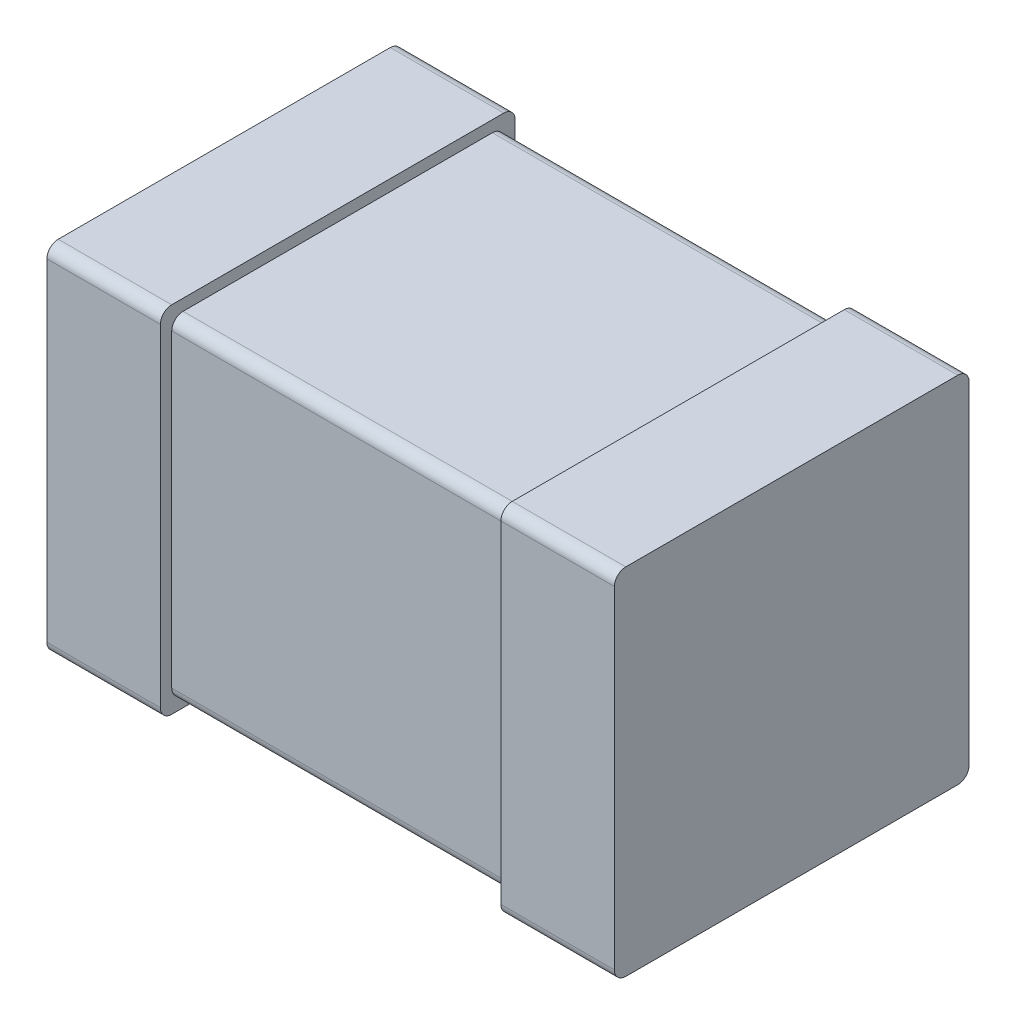
ISO-10303-21;
HEADER;
FILE_DESCRIPTION(('STEP AP214'),'2;1');
FILE_NAME('part.step','',(''),(''),'','','');
FILE_SCHEMA(('AUTOMOTIVE_DESIGN { 1 0 10303 214 1 1 1 1 }'));
ENDSEC;
DATA;
#1=APPLICATION_CONTEXT('core data for automotive mechanical design processes');
#2=APPLICATION_PROTOCOL_DEFINITION('international standard','automotive_design',2000,#1);
#3=PRODUCT_CONTEXT('',#1,'mechanical');
#4=PRODUCT('Part','Part','',(#3));
#5=PRODUCT_RELATED_PRODUCT_CATEGORY('part','',(#4));
#6=PRODUCT_DEFINITION_FORMATION('','',#4);
#7=PRODUCT_DEFINITION_CONTEXT('part definition',#1,'design');
#8=PRODUCT_DEFINITION('design','',#6,#7);
#9=PRODUCT_DEFINITION_SHAPE('','',#8);
#10=(LENGTH_UNIT() NAMED_UNIT(*) SI_UNIT(.MILLI.,.METRE.));
#11=(NAMED_UNIT(*) PLANE_ANGLE_UNIT() SI_UNIT($,.RADIAN.));
#12=(NAMED_UNIT(*) SI_UNIT($,.STERADIAN.) SOLID_ANGLE_UNIT());
#13=UNCERTAINTY_MEASURE_WITH_UNIT(LENGTH_MEASURE(1.E-05),#10,'distance_accuracy_value','');
#14=(GEOMETRIC_REPRESENTATION_CONTEXT(3) GLOBAL_UNCERTAINTY_ASSIGNED_CONTEXT((#13)) GLOBAL_UNIT_ASSIGNED_CONTEXT((#10,
#11,#12)) REPRESENTATION_CONTEXT('',''));
#15=CARTESIAN_POINT('',(0.,0.,0.));
#16=DIRECTION('',(0.,0.,1.));
#17=DIRECTION('',(1.,0.,0.));
#18=AXIS2_PLACEMENT_3D('',#15,#16,#17);
#19=CARTESIAN_POINT('',(1.,-0.625,0.));
#20=DIRECTION('',(1.,0.,0.));
#21=DIRECTION('',(0.,1.,0.));
#22=AXIS2_PLACEMENT_3D('',#19,#20,#21);
#23=PLANE('',#22);
#24=DIRECTION('',(0.,0.,1.));
#25=VECTOR('',#24,1.);
#26=CARTESIAN_POINT('',(1.,-0.625,0.));
#27=LINE('',#26,#25);
#28=CARTESIAN_POINT('',(1.,-0.625,0.04));
#29=VERTEX_POINT('',#28);
#30=CARTESIAN_POINT('',(1.,-0.625,1.21));
#31=VERTEX_POINT('',#30);
#32=EDGE_CURVE('E394',#29,#31,#27,.T.);
#33=ORIENTED_EDGE('',*,*,#32,.F.);
#34=CARTESIAN_POINT('',(1.,-0.585,0.04));
#35=DIRECTION('',(1.,0.,0.));
#36=DIRECTION('',(0.,0.,1.));
#37=AXIS2_PLACEMENT_3D('',#34,#35,#36);
#38=CIRCLE('',#37,0.04);
#39=CARTESIAN_POINT('',(1.,-0.585,0.));
#40=VERTEX_POINT('',#39);
#41=EDGE_CURVE('E355',#29,#40,#38,.T.);
#42=ORIENTED_EDGE('',*,*,#41,.T.);
#43=DIRECTION('',(0.,1.,0.));
#44=VECTOR('',#43,1.);
#45=CARTESIAN_POINT('',(1.,-0.625,0.));
#46=LINE('',#45,#44);
#47=CARTESIAN_POINT('',(1.,0.585,0.));
#48=VERTEX_POINT('',#47);
#49=EDGE_CURVE('E308',#40,#48,#46,.T.);
#50=ORIENTED_EDGE('',*,*,#49,.T.);
#51=CARTESIAN_POINT('',(1.,0.585,0.04));
#52=DIRECTION('',(-1.,0.,0.));
#53=DIRECTION('',(0.,0.,1.));
#54=AXIS2_PLACEMENT_3D('',#51,#52,#53);
#55=CIRCLE('',#54,0.04);
#56=CARTESIAN_POINT('',(1.,0.625,0.04));
#57=VERTEX_POINT('',#56);
#58=EDGE_CURVE('E184',#57,#48,#55,.T.);
#59=ORIENTED_EDGE('',*,*,#58,.F.);
#60=DIRECTION('',(0.,0.,1.));
#61=VECTOR('',#60,1.);
#62=CARTESIAN_POINT('',(1.,0.625,0.));
#63=LINE('',#62,#61);
#64=CARTESIAN_POINT('',(1.,0.625,1.21));
#65=VERTEX_POINT('',#64);
#66=EDGE_CURVE('E11',#57,#65,#63,.T.);
#67=ORIENTED_EDGE('',*,*,#66,.T.);
#68=CARTESIAN_POINT('',(1.,0.585,1.21));
#69=DIRECTION('',(1.,0.,0.));
#70=DIRECTION('',(0.,0.,1.));
#71=AXIS2_PLACEMENT_3D('',#68,#69,#70);
#72=CIRCLE('',#71,0.04);
#73=CARTESIAN_POINT('',(1.,0.585,1.25));
#74=VERTEX_POINT('',#73);
#75=EDGE_CURVE('E190',#65,#74,#72,.T.);
#76=ORIENTED_EDGE('',*,*,#75,.T.);
#77=DIRECTION('',(0.,1.,0.));
#78=VECTOR('',#77,1.);
#79=CARTESIAN_POINT('',(1.,-0.625,1.25));
#80=LINE('',#79,#78);
#81=CARTESIAN_POINT('',(1.,-0.585,1.25));
#82=VERTEX_POINT('',#81);
#83=EDGE_CURVE('E312',#82,#74,#80,.T.);
#84=ORIENTED_EDGE('',*,*,#83,.F.);
#85=CARTESIAN_POINT('',(1.,-0.585,1.21));
#86=DIRECTION('',(-1.,0.,0.));
#87=DIRECTION('',(0.,0.,1.));
#88=AXIS2_PLACEMENT_3D('',#85,#86,#87);
#89=CIRCLE('',#88,0.04);
#90=EDGE_CURVE('E351',#31,#82,#89,.T.);
#91=ORIENTED_EDGE('',*,*,#90,.F.);
#92=EDGE_LOOP('',(#33,#42,#50,#59,#67,#76,#84,#91));
#93=FACE_BOUND('',#92,.T.);
#94=ADVANCED_FACE('F17',(#93),#23,.T.);
#95=CARTESIAN_POINT('',(0.6,0.625,0.));
#96=DIRECTION('',(0.,1.,0.));
#97=DIRECTION('',(1.,0.,0.));
#98=AXIS2_PLACEMENT_3D('',#95,#96,#97);
#99=PLANE('',#98);
#100=ORIENTED_EDGE('',*,*,#66,.F.);
#101=DIRECTION('',(1.,0.,0.));
#102=VECTOR('',#101,1.);
#103=CARTESIAN_POINT('',(0.6,0.625,0.04));
#104=LINE('',#103,#102);
#105=CARTESIAN_POINT('',(0.6,0.625,0.04));
#106=VERTEX_POINT('',#105);
#107=EDGE_CURVE('E21',#106,#57,#104,.T.);
#108=ORIENTED_EDGE('',*,*,#107,.F.);
#109=DIRECTION('',(0.,0.,1.));
#110=VECTOR('',#109,1.);
#111=CARTESIAN_POINT('',(0.6,0.625,0.));
#112=LINE('',#111,#110);
#113=CARTESIAN_POINT('',(0.6,0.625,1.21));
#114=VERTEX_POINT('',#113);
#115=EDGE_CURVE('E340',#106,#114,#112,.T.);
#116=ORIENTED_EDGE('',*,*,#115,.T.);
#117=DIRECTION('',(1.,0.,0.));
#118=VECTOR('',#117,1.);
#119=CARTESIAN_POINT('',(0.6,0.625,1.21));
#120=LINE('',#119,#118);
#121=EDGE_CURVE('E28',#114,#65,#120,.T.);
#122=ORIENTED_EDGE('',*,*,#121,.T.);
#123=EDGE_LOOP('',(#100,#108,#116,#122));
#124=FACE_BOUND('',#123,.T.);
#125=ADVANCED_FACE('F603',(#124),#99,.T.);
#126=CARTESIAN_POINT('',(0.6,0.585,1.21));
#127=DIRECTION('',(1.,0.,0.));
#128=DIRECTION('',(0.,1.,0.));
#129=AXIS2_PLACEMENT_3D('',#126,#127,#128);
#130=CYLINDRICAL_SURFACE('',#129,0.04);
#131=CARTESIAN_POINT('',(0.6,0.585,1.21));
#132=DIRECTION('',(1.,0.,0.));
#133=DIRECTION('',(0.,0.,1.));
#134=AXIS2_PLACEMENT_3D('',#131,#132,#133);
#135=CIRCLE('',#134,0.04);
#136=CARTESIAN_POINT('',(0.6,0.585,1.25));
#137=VERTEX_POINT('',#136);
#138=EDGE_CURVE('E415',#114,#137,#135,.T.);
#139=ORIENTED_EDGE('',*,*,#138,.T.);
#140=DIRECTION('',(1.,0.,0.));
#141=VECTOR('',#140,1.);
#142=CARTESIAN_POINT('',(0.6,0.585,1.25));
#143=LINE('',#142,#141);
#144=EDGE_CURVE('E310',#137,#74,#143,.T.);
#145=ORIENTED_EDGE('',*,*,#144,.T.);
#146=ORIENTED_EDGE('',*,*,#75,.F.);
#147=ORIENTED_EDGE('',*,*,#121,.F.);
#148=EDGE_LOOP('',(#139,#145,#146,#147));
#149=FACE_BOUND('',#148,.T.);
#150=ADVANCED_FACE('F502',(#149),#130,.T.);
#151=CARTESIAN_POINT('',(0.6,0.585,0.04));
#152=DIRECTION('',(1.,0.,0.));
#153=DIRECTION('',(0.,1.,0.));
#154=AXIS2_PLACEMENT_3D('',#151,#152,#153);
#155=CYLINDRICAL_SURFACE('',#154,0.04);
#156=ORIENTED_EDGE('',*,*,#107,.T.);
#157=ORIENTED_EDGE('',*,*,#58,.T.);
#158=DIRECTION('',(1.,0.,0.));
#159=VECTOR('',#158,1.);
#160=CARTESIAN_POINT('',(0.6,0.585,0.));
#161=LINE('',#160,#159);
#162=CARTESIAN_POINT('',(0.6,0.585,0.));
#163=VERTEX_POINT('',#162);
#164=EDGE_CURVE('E305',#163,#48,#161,.T.);
#165=ORIENTED_EDGE('',*,*,#164,.F.);
#166=CARTESIAN_POINT('',(0.6,0.585,0.04));
#167=DIRECTION('',(-1.,0.,0.));
#168=DIRECTION('',(0.,0.,1.));
#169=AXIS2_PLACEMENT_3D('',#166,#167,#168);
#170=CIRCLE('',#169,0.04);
#171=EDGE_CURVE('E335',#106,#163,#170,.T.);
#172=ORIENTED_EDGE('',*,*,#171,.F.);
#173=EDGE_LOOP('',(#156,#157,#165,#172));
#174=FACE_BOUND('',#173,.T.);
#175=ADVANCED_FACE('F627',(#174),#155,.T.);
#176=CARTESIAN_POINT('',(0.6,-0.625,1.25));
#177=DIRECTION('',(0.,0.,1.));
#178=DIRECTION('',(1.,0.,0.));
#179=AXIS2_PLACEMENT_3D('',#176,#177,#178);
#180=PLANE('',#179);
#181=DIRECTION('',(0.,1.,0.));
#182=VECTOR('',#181,1.);
#183=CARTESIAN_POINT('',(0.6,-0.625,1.25));
#184=LINE('',#183,#182);
#185=CARTESIAN_POINT('',(0.6,-0.585,1.25));
#186=VERTEX_POINT('',#185);
#187=EDGE_CURVE('E412',#186,#137,#184,.T.);
#188=ORIENTED_EDGE('',*,*,#187,.F.);
#189=DIRECTION('',(1.,0.,0.));
#190=VECTOR('',#189,1.);
#191=CARTESIAN_POINT('',(0.6,-0.585,1.25));
#192=LINE('',#191,#190);
#193=EDGE_CURVE('E309',#186,#82,#192,.T.);
#194=ORIENTED_EDGE('',*,*,#193,.T.);
#195=ORIENTED_EDGE('',*,*,#83,.T.);
#196=ORIENTED_EDGE('',*,*,#144,.F.);
#197=EDGE_LOOP('',(#188,#194,#195,#196));
#198=FACE_BOUND('',#197,.T.);
#199=ADVANCED_FACE('F501',(#198),#180,.T.);
#200=CARTESIAN_POINT('',(0.6,-0.625,0.));
#201=DIRECTION('',(0.,0.,1.));
#202=DIRECTION('',(1.,0.,0.));
#203=AXIS2_PLACEMENT_3D('',#200,#201,#202);
#204=PLANE('',#203);
#205=ORIENTED_EDGE('',*,*,#164,.T.);
#206=ORIENTED_EDGE('',*,*,#49,.F.);
#207=DIRECTION('',(1.,0.,0.));
#208=VECTOR('',#207,1.);
#209=CARTESIAN_POINT('',(0.6,-0.585,0.));
#210=LINE('',#209,#208);
#211=CARTESIAN_POINT('',(0.6,-0.585,0.));
#212=VERTEX_POINT('',#211);
#213=EDGE_CURVE('E406',#212,#40,#210,.T.);
#214=ORIENTED_EDGE('',*,*,#213,.F.);
#215=DIRECTION('',(0.,1.,0.));
#216=VECTOR('',#215,1.);
#217=CARTESIAN_POINT('',(0.6,-0.625,0.));
#218=LINE('',#217,#216);
#219=EDGE_CURVE('E339',#212,#163,#218,.T.);
#220=ORIENTED_EDGE('',*,*,#219,.T.);
#221=EDGE_LOOP('',(#205,#206,#214,#220));
#222=FACE_BOUND('',#221,.T.);
#223=ADVANCED_FACE('F646',(#222),#204,.F.);
#224=CARTESIAN_POINT('',(0.6,-0.585,1.21));
#225=DIRECTION('',(1.,0.,0.));
#226=DIRECTION('',(0.,-1.,0.));
#227=AXIS2_PLACEMENT_3D('',#224,#225,#226);
#228=CYLINDRICAL_SURFACE('',#227,0.04);
#229=DIRECTION('',(1.,0.,0.));
#230=VECTOR('',#229,1.);
#231=CARTESIAN_POINT('',(0.6,-0.625,1.21));
#232=LINE('',#231,#230);
#233=CARTESIAN_POINT('',(0.6,-0.625,1.21));
#234=VERTEX_POINT('',#233);
#235=EDGE_CURVE('E303',#234,#31,#232,.T.);
#236=ORIENTED_EDGE('',*,*,#235,.T.);
#237=ORIENTED_EDGE('',*,*,#90,.T.);
#238=ORIENTED_EDGE('',*,*,#193,.F.);
#239=CARTESIAN_POINT('',(0.6,-0.585,1.21));
#240=DIRECTION('',(-1.,0.,0.));
#241=DIRECTION('',(0.,0.,1.));
#242=AXIS2_PLACEMENT_3D('',#239,#240,#241);
#243=CIRCLE('',#242,0.04);
#244=EDGE_CURVE('E416',#234,#186,#243,.T.);
#245=ORIENTED_EDGE('',*,*,#244,.F.);
#246=EDGE_LOOP('',(#236,#237,#238,#245));
#247=FACE_BOUND('',#246,.T.);
#248=ADVANCED_FACE('F498',(#247),#228,.T.);
#249=CARTESIAN_POINT('',(0.6,-0.585,0.04));
#250=DIRECTION('',(1.,0.,0.));
#251=DIRECTION('',(0.,-1.,0.));
#252=AXIS2_PLACEMENT_3D('',#249,#250,#251);
#253=CYLINDRICAL_SURFACE('',#252,0.04);
#254=CARTESIAN_POINT('',(0.6,-0.585,0.04));
#255=DIRECTION('',(1.,0.,0.));
#256=DIRECTION('',(0.,0.,1.));
#257=AXIS2_PLACEMENT_3D('',#254,#255,#256);
#258=CIRCLE('',#257,0.04);
#259=CARTESIAN_POINT('',(0.6,-0.625,0.04));
#260=VERTEX_POINT('',#259);
#261=EDGE_CURVE('E304',#260,#212,#258,.T.);
#262=ORIENTED_EDGE('',*,*,#261,.T.);
#263=ORIENTED_EDGE('',*,*,#213,.T.);
#264=ORIENTED_EDGE('',*,*,#41,.F.);
#265=DIRECTION('',(1.,0.,0.));
#266=VECTOR('',#265,1.);
#267=CARTESIAN_POINT('',(0.6,-0.625,0.04));
#268=LINE('',#267,#266);
#269=EDGE_CURVE('E390',#260,#29,#268,.T.);
#270=ORIENTED_EDGE('',*,*,#269,.F.);
#271=EDGE_LOOP('',(#262,#263,#264,#270));
#272=FACE_BOUND('',#271,.T.);
#273=ADVANCED_FACE('F610',(#272),#253,.T.);
#274=CARTESIAN_POINT('',(0.6,-0.625,0.));
#275=DIRECTION('',(0.,1.,0.));
#276=DIRECTION('',(1.,0.,0.));
#277=AXIS2_PLACEMENT_3D('',#274,#275,#276);
#278=PLANE('',#277);
#279=ORIENTED_EDGE('',*,*,#235,.F.);
#280=DIRECTION('',(0.,0.,1.));
#281=VECTOR('',#280,1.);
#282=CARTESIAN_POINT('',(0.6,-0.625,0.));
#283=LINE('',#282,#281);
#284=EDGE_CURVE('E299',#260,#234,#283,.T.);
#285=ORIENTED_EDGE('',*,*,#284,.F.);
#286=ORIENTED_EDGE('',*,*,#269,.T.);
#287=ORIENTED_EDGE('',*,*,#32,.T.);
#288=EDGE_LOOP('',(#279,#285,#286,#287));
#289=FACE_BOUND('',#288,.T.);
#290=ADVANCED_FACE('F495',(#289),#278,.F.);
#291=CARTESIAN_POINT('',(0.6,-0.625,0.));
#292=DIRECTION('',(1.,0.,0.));
#293=DIRECTION('',(0.,1.,0.));
#294=AXIS2_PLACEMENT_3D('',#291,#292,#293);
#295=PLANE('',#294);
#296=DIRECTION('',(0.,1.,0.));
#297=VECTOR('',#296,1.);
#298=CARTESIAN_POINT('',(0.6,-0.585,0.04));
#299=LINE('',#298,#297);
#300=CARTESIAN_POINT('',(0.6,-0.545,0.04));
#301=VERTEX_POINT('',#300);
#302=CARTESIAN_POINT('',(0.6,0.545,0.04));
#303=VERTEX_POINT('',#302);
#304=EDGE_CURVE('E385',#301,#303,#299,.T.);
#305=ORIENTED_EDGE('',*,*,#304,.T.);
#306=CARTESIAN_POINT('',(0.6,0.545,0.08));
#307=DIRECTION('',(-1.,0.,0.));
#308=DIRECTION('',(0.,0.,1.));
#309=AXIS2_PLACEMENT_3D('',#306,#307,#308);
#310=CIRCLE('',#309,0.04);
#311=CARTESIAN_POINT('',(0.6,0.585,0.08));
#312=VERTEX_POINT('',#311);
#313=EDGE_CURVE('E367',#312,#303,#310,.T.);
#314=ORIENTED_EDGE('',*,*,#313,.F.);
#315=DIRECTION('',(0.,0.,1.));
#316=VECTOR('',#315,1.);
#317=CARTESIAN_POINT('',(0.6,0.585,0.04));
#318=LINE('',#317,#316);
#319=CARTESIAN_POINT('',(0.6,0.585,1.17));
#320=VERTEX_POINT('',#319);
#321=EDGE_CURVE('E370',#312,#320,#318,.T.);
#322=ORIENTED_EDGE('',*,*,#321,.T.);
#323=CARTESIAN_POINT('',(0.6,0.545,1.17));
#324=DIRECTION('',(1.,0.,0.));
#325=DIRECTION('',(0.,0.,1.));
#326=AXIS2_PLACEMENT_3D('',#323,#324,#325);
#327=CIRCLE('',#326,0.04);
#328=CARTESIAN_POINT('',(0.6,0.545,1.21));
#329=VERTEX_POINT('',#328);
#330=EDGE_CURVE('E356',#320,#329,#327,.T.);
#331=ORIENTED_EDGE('',*,*,#330,.T.);
#332=DIRECTION('',(0.,1.,0.));
#333=VECTOR('',#332,1.);
#334=CARTESIAN_POINT('',(0.6,-0.585,1.21));
#335=LINE('',#334,#333);
#336=CARTESIAN_POINT('',(0.6,-0.545,1.21));
#337=VERTEX_POINT('',#336);
#338=EDGE_CURVE('E346',#337,#329,#335,.T.);
#339=ORIENTED_EDGE('',*,*,#338,.F.);
#340=CARTESIAN_POINT('',(0.6,-0.545,1.17));
#341=DIRECTION('',(-1.,0.,0.));
#342=DIRECTION('',(0.,0.,1.));
#343=AXIS2_PLACEMENT_3D('',#340,#341,#342);
#344=CIRCLE('',#343,0.04);
#345=CARTESIAN_POINT('',(0.6,-0.585,1.17));
#346=VERTEX_POINT('',#345);
#347=EDGE_CURVE('E345',#346,#337,#344,.T.);
#348=ORIENTED_EDGE('',*,*,#347,.F.);
#349=DIRECTION('',(0.,0.,1.));
#350=VECTOR('',#349,1.);
#351=CARTESIAN_POINT('',(0.6,-0.585,0.04));
#352=LINE('',#351,#350);
#353=CARTESIAN_POINT('',(0.6,-0.585,0.08));
#354=VERTEX_POINT('',#353);
#355=EDGE_CURVE('E425',#354,#346,#352,.T.);
#356=ORIENTED_EDGE('',*,*,#355,.F.);
#357=CARTESIAN_POINT('',(0.6,-0.545,0.08));
#358=DIRECTION('',(1.,0.,0.));
#359=DIRECTION('',(0.,0.,1.));
#360=AXIS2_PLACEMENT_3D('',#357,#358,#359);
#361=CIRCLE('',#360,0.04);
#362=EDGE_CURVE('E376',#354,#301,#361,.T.);
#363=ORIENTED_EDGE('',*,*,#362,.T.);
#364=EDGE_LOOP('',(#305,#314,#322,#331,#339,#348,#356,#363));
#365=FACE_BOUND('',#364,.T.);
#366=ORIENTED_EDGE('',*,*,#244,.T.);
#367=ORIENTED_EDGE('',*,*,#187,.T.);
#368=ORIENTED_EDGE('',*,*,#138,.F.);
#369=ORIENTED_EDGE('',*,*,#115,.F.);
#370=ORIENTED_EDGE('',*,*,#171,.T.);
#371=ORIENTED_EDGE('',*,*,#219,.F.);
#372=ORIENTED_EDGE('',*,*,#261,.F.);
#373=ORIENTED_EDGE('',*,*,#284,.T.);
#374=EDGE_LOOP('',(#366,#367,#368,#369,#370,#371,#372,#373));
#375=FACE_BOUND('',#374,.T.);
#376=ADVANCED_FACE('F462',(#365,#375),#295,.F.);
#377=CARTESIAN_POINT('',(-0.6,-0.585,0.04));
#378=DIRECTION('',(0.,1.,0.));
#379=DIRECTION('',(1.,0.,0.));
#380=AXIS2_PLACEMENT_3D('',#377,#378,#379);
#381=PLANE('',#380);
#382=DIRECTION('',(1.,0.,0.));
#383=VECTOR('',#382,1.);
#384=CARTESIAN_POINT('',(-0.6,-0.585,1.17));
#385=LINE('',#384,#383);
#386=CARTESIAN_POINT('',(-0.6,-0.585,1.17));
#387=VERTEX_POINT('',#386);
#388=EDGE_CURVE('E341',#387,#346,#385,.T.);
#389=ORIENTED_EDGE('',*,*,#388,.F.);
#390=DIRECTION('',(0.,0.,1.));
#391=VECTOR('',#390,1.);
#392=CARTESIAN_POINT('',(-0.6,-0.585,0.04));
#393=LINE('',#392,#391);
#394=CARTESIAN_POINT('',(-0.6,-0.585,0.08));
#395=VERTEX_POINT('',#394);
#396=EDGE_CURVE('E531',#395,#387,#393,.T.);
#397=ORIENTED_EDGE('',*,*,#396,.F.);
#398=DIRECTION('',(1.,0.,0.));
#399=VECTOR('',#398,1.);
#400=CARTESIAN_POINT('',(-0.6,-0.585,0.08));
#401=LINE('',#400,#399);
#402=EDGE_CURVE('E283',#395,#354,#401,.T.);
#403=ORIENTED_EDGE('',*,*,#402,.T.);
#404=ORIENTED_EDGE('',*,*,#355,.T.);
#405=EDGE_LOOP('',(#389,#397,#403,#404));
#406=FACE_BOUND('',#405,.T.);
#407=ADVANCED_FACE('F19',(#406),#381,.F.);
#408=CARTESIAN_POINT('',(-0.6,-0.545,1.17));
#409=DIRECTION('',(1.,0.,0.));
#410=DIRECTION('',(0.,-1.,0.));
#411=AXIS2_PLACEMENT_3D('',#408,#409,#410);
#412=CYLINDRICAL_SURFACE('',#411,0.04);
#413=ORIENTED_EDGE('',*,*,#388,.T.);
#414=ORIENTED_EDGE('',*,*,#347,.T.);
#415=DIRECTION('',(1.,0.,0.));
#416=VECTOR('',#415,1.);
#417=CARTESIAN_POINT('',(-0.6,-0.545,1.21));
#418=LINE('',#417,#416);
#419=CARTESIAN_POINT('',(-0.6,-0.545,1.21));
#420=VERTEX_POINT('',#419);
#421=EDGE_CURVE('E360',#420,#337,#418,.T.);
#422=ORIENTED_EDGE('',*,*,#421,.F.);
#423=CARTESIAN_POINT('',(-0.6,-0.545,1.17));
#424=DIRECTION('',(-1.,0.,0.));
#425=DIRECTION('',(0.,0.,1.));
#426=AXIS2_PLACEMENT_3D('',#423,#424,#425);
#427=CIRCLE('',#426,0.04);
#428=EDGE_CURVE('E402',#387,#420,#427,.T.);
#429=ORIENTED_EDGE('',*,*,#428,.F.);
#430=EDGE_LOOP('',(#413,#414,#422,#429));
#431=FACE_BOUND('',#430,.T.);
#432=ADVANCED_FACE('F458',(#431),#412,.T.);
#433=CARTESIAN_POINT('',(-0.6,-0.585,1.21));
#434=DIRECTION('',(0.,0.,1.));
#435=DIRECTION('',(1.,0.,0.));
#436=AXIS2_PLACEMENT_3D('',#433,#434,#435);
#437=PLANE('',#436);
#438=DIRECTION('',(0.,1.,0.));
#439=VECTOR('',#438,1.);
#440=CARTESIAN_POINT('',(-0.6,-0.585,1.21));
#441=LINE('',#440,#439);
#442=CARTESIAN_POINT('',(-0.6,0.545,1.21));
#443=VERTEX_POINT('',#442);
#444=EDGE_CURVE('E397',#420,#443,#441,.T.);
#445=ORIENTED_EDGE('',*,*,#444,.F.);
#446=ORIENTED_EDGE('',*,*,#421,.T.);
#447=ORIENTED_EDGE('',*,*,#338,.T.);
#448=DIRECTION('',(1.,0.,0.));
#449=VECTOR('',#448,1.);
#450=CARTESIAN_POINT('',(-0.6,0.545,1.21));
#451=LINE('',#450,#449);
#452=EDGE_CURVE('E97',#443,#329,#451,.T.);
#453=ORIENTED_EDGE('',*,*,#452,.F.);
#454=EDGE_LOOP('',(#445,#446,#447,#453));
#455=FACE_BOUND('',#454,.T.);
#456=ADVANCED_FACE('F465',(#455),#437,.T.);
#457=CARTESIAN_POINT('',(-0.6,0.545,1.17));
#458=DIRECTION('',(1.,0.,0.));
#459=DIRECTION('',(0.,1.,0.));
#460=AXIS2_PLACEMENT_3D('',#457,#458,#459);
#461=CYLINDRICAL_SURFACE('',#460,0.04);
#462=CARTESIAN_POINT('',(-0.6,0.545,1.17));
#463=DIRECTION('',(1.,0.,0.));
#464=DIRECTION('',(0.,0.,1.));
#465=AXIS2_PLACEMENT_3D('',#462,#463,#464);
#466=CIRCLE('',#465,0.04);
#467=CARTESIAN_POINT('',(-0.6,0.585,1.17));
#468=VERTEX_POINT('',#467);
#469=EDGE_CURVE('E401',#468,#443,#466,.T.);
#470=ORIENTED_EDGE('',*,*,#469,.T.);
#471=ORIENTED_EDGE('',*,*,#452,.T.);
#472=ORIENTED_EDGE('',*,*,#330,.F.);
#473=DIRECTION('',(1.,0.,0.));
#474=VECTOR('',#473,1.);
#475=CARTESIAN_POINT('',(-0.6,0.585,1.17));
#476=LINE('',#475,#474);
#477=EDGE_CURVE('E109',#468,#320,#476,.T.);
#478=ORIENTED_EDGE('',*,*,#477,.F.);
#479=EDGE_LOOP('',(#470,#471,#472,#478));
#480=FACE_BOUND('',#479,.T.);
#481=ADVANCED_FACE('F637',(#480),#461,.T.);
#482=CARTESIAN_POINT('',(-0.6,0.585,0.04));
#483=DIRECTION('',(0.,1.,0.));
#484=DIRECTION('',(1.,0.,0.));
#485=AXIS2_PLACEMENT_3D('',#482,#483,#484);
#486=PLANE('',#485);
#487=ORIENTED_EDGE('',*,*,#321,.F.);
#488=DIRECTION('',(1.,0.,0.));
#489=VECTOR('',#488,1.);
#490=CARTESIAN_POINT('',(-0.6,0.585,0.08));
#491=LINE('',#490,#489);
#492=CARTESIAN_POINT('',(-0.6,0.585,0.08));
#493=VERTEX_POINT('',#492);
#494=EDGE_CURVE('E371',#493,#312,#491,.T.);
#495=ORIENTED_EDGE('',*,*,#494,.F.);
#496=DIRECTION('',(0.,0.,1.));
#497=VECTOR('',#496,1.);
#498=CARTESIAN_POINT('',(-0.6,0.585,0.04));
#499=LINE('',#498,#497);
#500=EDGE_CURVE('E448',#493,#468,#499,.T.);
#501=ORIENTED_EDGE('',*,*,#500,.T.);
#502=ORIENTED_EDGE('',*,*,#477,.T.);
#503=EDGE_LOOP('',(#487,#495,#501,#502));
#504=FACE_BOUND('',#503,.T.);
#505=ADVANCED_FACE('F617',(#504),#486,.T.);
#506=CARTESIAN_POINT('',(-0.6,0.545,0.08));
#507=DIRECTION('',(1.,0.,0.));
#508=DIRECTION('',(0.,1.,0.));
#509=AXIS2_PLACEMENT_3D('',#506,#507,#508);
#510=CYLINDRICAL_SURFACE('',#509,0.04);
#511=ORIENTED_EDGE('',*,*,#494,.T.);
#512=ORIENTED_EDGE('',*,*,#313,.T.);
#513=DIRECTION('',(1.,0.,0.));
#514=VECTOR('',#513,1.);
#515=CARTESIAN_POINT('',(-0.6,0.545,0.04));
#516=LINE('',#515,#514);
#517=CARTESIAN_POINT('',(-0.6,0.545,0.04));
#518=VERTEX_POINT('',#517);
#519=EDGE_CURVE('E389',#518,#303,#516,.T.);
#520=ORIENTED_EDGE('',*,*,#519,.F.);
#521=CARTESIAN_POINT('',(-0.6,0.545,0.08));
#522=DIRECTION('',(-1.,0.,0.));
#523=DIRECTION('',(0.,0.,1.));
#524=AXIS2_PLACEMENT_3D('',#521,#522,#523);
#525=CIRCLE('',#524,0.04);
#526=EDGE_CURVE('E329',#493,#518,#525,.T.);
#527=ORIENTED_EDGE('',*,*,#526,.F.);
#528=EDGE_LOOP('',(#511,#512,#520,#527));
#529=FACE_BOUND('',#528,.T.);
#530=ADVANCED_FACE('F614',(#529),#510,.T.);
#531=CARTESIAN_POINT('',(-0.6,-0.585,0.04));
#532=DIRECTION('',(0.,0.,1.));
#533=DIRECTION('',(1.,0.,0.));
#534=AXIS2_PLACEMENT_3D('',#531,#532,#533);
#535=PLANE('',#534);
#536=ORIENTED_EDGE('',*,*,#519,.T.);
#537=ORIENTED_EDGE('',*,*,#304,.F.);
#538=DIRECTION('',(1.,0.,0.));
#539=VECTOR('',#538,1.);
#540=CARTESIAN_POINT('',(-0.6,-0.545,0.04));
#541=LINE('',#540,#539);
#542=CARTESIAN_POINT('',(-0.6,-0.545,0.04));
#543=VERTEX_POINT('',#542);
#544=EDGE_CURVE('E372',#543,#301,#541,.T.);
#545=ORIENTED_EDGE('',*,*,#544,.F.);
#546=DIRECTION('',(0.,1.,0.));
#547=VECTOR('',#546,1.);
#548=CARTESIAN_POINT('',(-0.6,-0.585,0.04));
#549=LINE('',#548,#547);
#550=EDGE_CURVE('E377',#543,#518,#549,.T.);
#551=ORIENTED_EDGE('',*,*,#550,.T.);
#552=EDGE_LOOP('',(#536,#537,#545,#551));
#553=FACE_BOUND('',#552,.T.);
#554=ADVANCED_FACE('F537',(#553),#535,.F.);
#555=CARTESIAN_POINT('',(-0.6,-0.545,0.08));
#556=DIRECTION('',(1.,0.,0.));
#557=DIRECTION('',(0.,-1.,0.));
#558=AXIS2_PLACEMENT_3D('',#555,#556,#557);
#559=CYLINDRICAL_SURFACE('',#558,0.04);
#560=CARTESIAN_POINT('',(-0.6,-0.545,0.08));
#561=DIRECTION('',(1.,0.,0.));
#562=DIRECTION('',(0.,0.,1.));
#563=AXIS2_PLACEMENT_3D('',#560,#561,#562);
#564=CIRCLE('',#563,0.04);
#565=EDGE_CURVE('E297',#395,#543,#564,.T.);
#566=ORIENTED_EDGE('',*,*,#565,.T.);
#567=ORIENTED_EDGE('',*,*,#544,.T.);
#568=ORIENTED_EDGE('',*,*,#362,.F.);
#569=ORIENTED_EDGE('',*,*,#402,.F.);
#570=EDGE_LOOP('',(#566,#567,#568,#569));
#571=FACE_BOUND('',#570,.T.);
#572=ADVANCED_FACE('F535',(#571),#559,.T.);
#573=CARTESIAN_POINT('',(-0.6,-0.625,0.));
#574=DIRECTION('',(1.,0.,0.));
#575=DIRECTION('',(0.,1.,0.));
#576=AXIS2_PLACEMENT_3D('',#573,#574,#575);
#577=PLANE('',#576);
#578=ORIENTED_EDGE('',*,*,#565,.F.);
#579=ORIENTED_EDGE('',*,*,#396,.T.);
#580=ORIENTED_EDGE('',*,*,#428,.T.);
#581=ORIENTED_EDGE('',*,*,#444,.T.);
#582=ORIENTED_EDGE('',*,*,#469,.F.);
#583=ORIENTED_EDGE('',*,*,#500,.F.);
#584=ORIENTED_EDGE('',*,*,#526,.T.);
#585=ORIENTED_EDGE('',*,*,#550,.F.);
#586=EDGE_LOOP('',(#578,#579,#580,#581,#582,#583,#584,#585));
#587=FACE_BOUND('',#586,.T.);
#588=DIRECTION('',(0.,0.,1.));
#589=VECTOR('',#588,1.);
#590=CARTESIAN_POINT('',(-0.6,-0.625,0.));
#591=LINE('',#590,#589);
#592=CARTESIAN_POINT('',(-0.6,-0.625,0.04));
#593=VERTEX_POINT('',#592);
#594=CARTESIAN_POINT('',(-0.6,-0.625,1.21));
#595=VERTEX_POINT('',#594);
#596=EDGE_CURVE('E257',#593,#595,#591,.T.);
#597=ORIENTED_EDGE('',*,*,#596,.F.);
#598=CARTESIAN_POINT('',(-0.6,-0.585,0.04));
#599=DIRECTION('',(1.,0.,0.));
#600=DIRECTION('',(0.,0.,1.));
#601=AXIS2_PLACEMENT_3D('',#598,#599,#600);
#602=CIRCLE('',#601,0.04);
#603=CARTESIAN_POINT('',(-0.6,-0.585,0.));
#604=VERTEX_POINT('',#603);
#605=EDGE_CURVE('E252',#593,#604,#602,.T.);
#606=ORIENTED_EDGE('',*,*,#605,.T.);
#607=DIRECTION('',(0.,1.,0.));
#608=VECTOR('',#607,1.);
#609=CARTESIAN_POINT('',(-0.6,-0.625,0.));
#610=LINE('',#609,#608);
#611=CARTESIAN_POINT('',(-0.6,0.585,0.));
#612=VERTEX_POINT('',#611);
#613=EDGE_CURVE('E331',#604,#612,#610,.T.);
#614=ORIENTED_EDGE('',*,*,#613,.T.);
#615=CARTESIAN_POINT('',(-0.6,0.585,0.04));
#616=DIRECTION('',(-1.,0.,0.));
#617=DIRECTION('',(0.,0.,1.));
#618=AXIS2_PLACEMENT_3D('',#615,#616,#617);
#619=CIRCLE('',#618,0.04);
#620=CARTESIAN_POINT('',(-0.6,0.625,0.04));
#621=VERTEX_POINT('',#620);
#622=EDGE_CURVE('E384',#621,#612,#619,.T.);
#623=ORIENTED_EDGE('',*,*,#622,.F.);
#624=DIRECTION('',(0.,0.,1.));
#625=VECTOR('',#624,1.);
#626=CARTESIAN_POINT('',(-0.6,0.625,0.));
#627=LINE('',#626,#625);
#628=CARTESIAN_POINT('',(-0.6,0.625,1.21));
#629=VERTEX_POINT('',#628);
#630=EDGE_CURVE('E293',#621,#629,#627,.T.);
#631=ORIENTED_EDGE('',*,*,#630,.T.);
#632=CARTESIAN_POINT('',(-0.6,0.585,1.21));
#633=DIRECTION('',(1.,0.,0.));
#634=DIRECTION('',(0.,0.,1.));
#635=AXIS2_PLACEMENT_3D('',#632,#633,#634);
#636=CIRCLE('',#635,0.04);
#637=CARTESIAN_POINT('',(-0.6,0.585,1.25));
#638=VERTEX_POINT('',#637);
#639=EDGE_CURVE('E350',#629,#638,#636,.T.);
#640=ORIENTED_EDGE('',*,*,#639,.T.);
#641=DIRECTION('',(0.,1.,0.));
#642=VECTOR('',#641,1.);
#643=CARTESIAN_POINT('',(-0.6,-0.625,1.25));
#644=LINE('',#643,#642);
#645=CARTESIAN_POINT('',(-0.6,-0.585,1.25));
#646=VERTEX_POINT('',#645);
#647=EDGE_CURVE('E289',#646,#638,#644,.T.);
#648=ORIENTED_EDGE('',*,*,#647,.F.);
#649=CARTESIAN_POINT('',(-0.6,-0.585,1.21));
#650=DIRECTION('',(-1.,0.,0.));
#651=DIRECTION('',(0.,0.,1.));
#652=AXIS2_PLACEMENT_3D('',#649,#650,#651);
#653=CIRCLE('',#652,0.04);
#654=EDGE_CURVE('E435',#595,#646,#653,.T.);
#655=ORIENTED_EDGE('',*,*,#654,.F.);
#656=EDGE_LOOP('',(#597,#606,#614,#623,#631,#640,#648,#655));
#657=FACE_BOUND('',#656,.T.);
#658=ADVANCED_FACE('F541',(#587,#657),#577,.T.);
#659=CARTESIAN_POINT('',(-1.,0.625,0.));
#660=DIRECTION('',(0.,1.,0.));
#661=DIRECTION('',(1.,0.,0.));
#662=AXIS2_PLACEMENT_3D('',#659,#660,#661);
#663=PLANE('',#662);
#664=ORIENTED_EDGE('',*,*,#630,.F.);
#665=DIRECTION('',(1.,0.,0.));
#666=VECTOR('',#665,1.);
#667=CARTESIAN_POINT('',(-1.,0.625,0.04));
#668=LINE('',#667,#666);
#669=CARTESIAN_POINT('',(-1.,0.625,0.04));
#670=VERTEX_POINT('',#669);
#671=EDGE_CURVE('E288',#670,#621,#668,.T.);
#672=ORIENTED_EDGE('',*,*,#671,.F.);
#673=DIRECTION('',(0.,0.,1.));
#674=VECTOR('',#673,1.);
#675=CARTESIAN_POINT('',(-1.,0.625,0.));
#676=LINE('',#675,#674);
#677=CARTESIAN_POINT('',(-1.,0.625,1.21));
#678=VERTEX_POINT('',#677);
#679=EDGE_CURVE('E365',#670,#678,#676,.T.);
#680=ORIENTED_EDGE('',*,*,#679,.T.);
#681=DIRECTION('',(1.,0.,0.));
#682=VECTOR('',#681,1.);
#683=CARTESIAN_POINT('',(-1.,0.625,1.21));
#684=LINE('',#683,#682);
#685=EDGE_CURVE('E298',#678,#629,#684,.T.);
#686=ORIENTED_EDGE('',*,*,#685,.T.);
#687=EDGE_LOOP('',(#664,#672,#680,#686));
#688=FACE_BOUND('',#687,.T.);
#689=ADVANCED_FACE('F578',(#688),#663,.T.);
#690=CARTESIAN_POINT('',(-1.,0.585,1.21));
#691=DIRECTION('',(1.,0.,0.));
#692=DIRECTION('',(0.,1.,0.));
#693=AXIS2_PLACEMENT_3D('',#690,#691,#692);
#694=CYLINDRICAL_SURFACE('',#693,0.04);
#695=CARTESIAN_POINT('',(-1.,0.585,1.21));
#696=DIRECTION('',(1.,0.,0.));
#697=DIRECTION('',(0.,0.,1.));
#698=AXIS2_PLACEMENT_3D('',#695,#696,#697);
#699=CIRCLE('',#698,0.04);
#700=CARTESIAN_POINT('',(-1.,0.585,1.25));
#701=VERTEX_POINT('',#700);
#702=EDGE_CURVE('E361',#678,#701,#699,.T.);
#703=ORIENTED_EDGE('',*,*,#702,.T.);
#704=DIRECTION('',(1.,0.,0.));
#705=VECTOR('',#704,1.);
#706=CARTESIAN_POINT('',(-1.,0.585,1.25));
#707=LINE('',#706,#705);
#708=EDGE_CURVE('E285',#701,#638,#707,.T.);
#709=ORIENTED_EDGE('',*,*,#708,.T.);
#710=ORIENTED_EDGE('',*,*,#639,.F.);
#711=ORIENTED_EDGE('',*,*,#685,.F.);
#712=EDGE_LOOP('',(#703,#709,#710,#711));
#713=FACE_BOUND('',#712,.T.);
#714=ADVANCED_FACE('F576',(#713),#694,.T.);
#715=CARTESIAN_POINT('',(-1.,0.585,0.04));
#716=DIRECTION('',(1.,0.,0.));
#717=DIRECTION('',(0.,1.,0.));
#718=AXIS2_PLACEMENT_3D('',#715,#716,#717);
#719=CYLINDRICAL_SURFACE('',#718,0.04);
#720=ORIENTED_EDGE('',*,*,#671,.T.);
#721=ORIENTED_EDGE('',*,*,#622,.T.);
#722=DIRECTION('',(1.,0.,0.));
#723=VECTOR('',#722,1.);
#724=CARTESIAN_POINT('',(-1.,0.585,0.));
#725=LINE('',#724,#723);
#726=CARTESIAN_POINT('',(-1.,0.585,0.));
#727=VERTEX_POINT('',#726);
#728=EDGE_CURVE('E334',#727,#612,#725,.T.);
#729=ORIENTED_EDGE('',*,*,#728,.F.);
#730=CARTESIAN_POINT('',(-1.,0.585,0.04));
#731=DIRECTION('',(-1.,0.,0.));
#732=DIRECTION('',(0.,0.,1.));
#733=AXIS2_PLACEMENT_3D('',#730,#731,#732);
#734=CIRCLE('',#733,0.04);
#735=EDGE_CURVE('E279',#670,#727,#734,.T.);
#736=ORIENTED_EDGE('',*,*,#735,.F.);
#737=EDGE_LOOP('',(#720,#721,#729,#736));
#738=FACE_BOUND('',#737,.T.);
#739=ADVANCED_FACE('F582',(#738),#719,.T.);
#740=CARTESIAN_POINT('',(-1.,-0.625,1.25));
#741=DIRECTION('',(0.,0.,1.));
#742=DIRECTION('',(1.,0.,0.));
#743=AXIS2_PLACEMENT_3D('',#740,#741,#742);
#744=PLANE('',#743);
#745=DIRECTION('',(0.,1.,0.));
#746=VECTOR('',#745,1.);
#747=CARTESIAN_POINT('',(-1.,-0.625,1.25));
#748=LINE('',#747,#746);
#749=CARTESIAN_POINT('',(-1.,-0.585,1.25));
#750=VERTEX_POINT('',#749);
#751=EDGE_CURVE('E366',#750,#701,#748,.T.);
#752=ORIENTED_EDGE('',*,*,#751,.F.);
#753=DIRECTION('',(1.,0.,0.));
#754=VECTOR('',#753,1.);
#755=CARTESIAN_POINT('',(-1.,-0.585,1.25));
#756=LINE('',#755,#754);
#757=EDGE_CURVE('E487',#750,#646,#756,.T.);
#758=ORIENTED_EDGE('',*,*,#757,.T.);
#759=ORIENTED_EDGE('',*,*,#647,.T.);
#760=ORIENTED_EDGE('',*,*,#708,.F.);
#761=EDGE_LOOP('',(#752,#758,#759,#760));
#762=FACE_BOUND('',#761,.T.);
#763=ADVANCED_FACE('F572',(#762),#744,.T.);
#764=CARTESIAN_POINT('',(-1.,-0.625,0.));
#765=DIRECTION('',(0.,0.,1.));
#766=DIRECTION('',(1.,0.,0.));
#767=AXIS2_PLACEMENT_3D('',#764,#765,#766);
#768=PLANE('',#767);
#769=ORIENTED_EDGE('',*,*,#728,.T.);
#770=ORIENTED_EDGE('',*,*,#613,.F.);
#771=DIRECTION('',(1.,0.,0.));
#772=VECTOR('',#771,1.);
#773=CARTESIAN_POINT('',(-1.,-0.585,0.));
#774=LINE('',#773,#772);
#775=CARTESIAN_POINT('',(-1.,-0.585,0.));
#776=VERTEX_POINT('',#775);
#777=EDGE_CURVE('E290',#776,#604,#774,.T.);
#778=ORIENTED_EDGE('',*,*,#777,.F.);
#779=DIRECTION('',(0.,1.,0.));
#780=VECTOR('',#779,1.);
#781=CARTESIAN_POINT('',(-1.,-0.625,0.));
#782=LINE('',#781,#780);
#783=EDGE_CURVE('E272',#776,#727,#782,.T.);
#784=ORIENTED_EDGE('',*,*,#783,.T.);
#785=EDGE_LOOP('',(#769,#770,#778,#784));
#786=FACE_BOUND('',#785,.T.);
#787=ADVANCED_FACE('F585',(#786),#768,.F.);
#788=CARTESIAN_POINT('',(-1.,-0.585,1.21));
#789=DIRECTION('',(1.,0.,0.));
#790=DIRECTION('',(0.,-1.,0.));
#791=AXIS2_PLACEMENT_3D('',#788,#789,#790);
#792=CYLINDRICAL_SURFACE('',#791,0.04);
#793=DIRECTION('',(1.,0.,0.));
#794=VECTOR('',#793,1.);
#795=CARTESIAN_POINT('',(-1.,-0.625,1.21));
#796=LINE('',#795,#794);
#797=CARTESIAN_POINT('',(-1.,-0.625,1.21));
#798=VERTEX_POINT('',#797);
#799=EDGE_CURVE('E258',#798,#595,#796,.T.);
#800=ORIENTED_EDGE('',*,*,#799,.T.);
#801=ORIENTED_EDGE('',*,*,#654,.T.);
#802=ORIENTED_EDGE('',*,*,#757,.F.);
#803=CARTESIAN_POINT('',(-1.,-0.585,1.21));
#804=DIRECTION('',(-1.,0.,0.));
#805=DIRECTION('',(0.,0.,1.));
#806=AXIS2_PLACEMENT_3D('',#803,#804,#805);
#807=CIRCLE('',#806,0.04);
#808=EDGE_CURVE('E449',#798,#750,#807,.T.);
#809=ORIENTED_EDGE('',*,*,#808,.F.);
#810=EDGE_LOOP('',(#800,#801,#802,#809));
#811=FACE_BOUND('',#810,.T.);
#812=ADVANCED_FACE('F568',(#811),#792,.T.);
#813=CARTESIAN_POINT('',(-1.,-0.585,0.04));
#814=DIRECTION('',(1.,0.,0.));
#815=DIRECTION('',(0.,-1.,0.));
#816=AXIS2_PLACEMENT_3D('',#813,#814,#815);
#817=CYLINDRICAL_SURFACE('',#816,0.04);
#818=CARTESIAN_POINT('',(-1.,-0.585,0.04));
#819=DIRECTION('',(1.,0.,0.));
#820=DIRECTION('',(0.,0.,1.));
#821=AXIS2_PLACEMENT_3D('',#818,#819,#820);
#822=CIRCLE('',#821,0.04);
#823=CARTESIAN_POINT('',(-1.,-0.625,0.04));
#824=VERTEX_POINT('',#823);
#825=EDGE_CURVE('E249',#824,#776,#822,.T.);
#826=ORIENTED_EDGE('',*,*,#825,.T.);
#827=ORIENTED_EDGE('',*,*,#777,.T.);
#828=ORIENTED_EDGE('',*,*,#605,.F.);
#829=DIRECTION('',(1.,0.,0.));
#830=VECTOR('',#829,1.);
#831=CARTESIAN_POINT('',(-1.,-0.625,0.04));
#832=LINE('',#831,#830);
#833=EDGE_CURVE('E244',#824,#593,#832,.T.);
#834=ORIENTED_EDGE('',*,*,#833,.F.);
#835=EDGE_LOOP('',(#826,#827,#828,#834));
#836=FACE_BOUND('',#835,.T.);
#837=ADVANCED_FACE('F246',(#836),#817,.T.);
#838=CARTESIAN_POINT('',(-1.,-0.625,0.));
#839=DIRECTION('',(0.,1.,0.));
#840=DIRECTION('',(1.,0.,0.));
#841=AXIS2_PLACEMENT_3D('',#838,#839,#840);
#842=PLANE('',#841);
#843=ORIENTED_EDGE('',*,*,#799,.F.);
#844=DIRECTION('',(0.,0.,1.));
#845=VECTOR('',#844,1.);
#846=CARTESIAN_POINT('',(-1.,-0.625,0.));
#847=LINE('',#846,#845);
#848=EDGE_CURVE('E261',#824,#798,#847,.T.);
#849=ORIENTED_EDGE('',*,*,#848,.F.);
#850=ORIENTED_EDGE('',*,*,#833,.T.);
#851=ORIENTED_EDGE('',*,*,#596,.T.);
#852=EDGE_LOOP('',(#843,#849,#850,#851));
#853=FACE_BOUND('',#852,.T.);
#854=ADVANCED_FACE('F262',(#853),#842,.F.);
#855=CARTESIAN_POINT('',(-1.,-0.625,0.));
#856=DIRECTION('',(1.,0.,0.));
#857=DIRECTION('',(0.,1.,0.));
#858=AXIS2_PLACEMENT_3D('',#855,#856,#857);
#859=PLANE('',#858);
#860=ORIENTED_EDGE('',*,*,#808,.T.);
#861=ORIENTED_EDGE('',*,*,#751,.T.);
#862=ORIENTED_EDGE('',*,*,#702,.F.);
#863=ORIENTED_EDGE('',*,*,#679,.F.);
#864=ORIENTED_EDGE('',*,*,#735,.T.);
#865=ORIENTED_EDGE('',*,*,#783,.F.);
#866=ORIENTED_EDGE('',*,*,#825,.F.);
#867=ORIENTED_EDGE('',*,*,#848,.T.);
#868=EDGE_LOOP('',(#860,#861,#862,#863,#864,#865,#866,#867));
#869=FACE_BOUND('',#868,.T.);
#870=ADVANCED_FACE('F269',(#869),#859,.F.);
#871=CLOSED_SHELL('',(#94,#125,#150,#175,#199,#223,#248,#273,#290,#376,#407,#432,#456,#481,#505,
#530,#554,#572,#658,#689,#714,#739,#763,#787,#812,#837,#854,#870));
#872=MANIFOLD_SOLID_BREP('B1',#871);
#873=ADVANCED_BREP_SHAPE_REPRESENTATION('',(#18,#872),#14);
#874=SHAPE_DEFINITION_REPRESENTATION(#9,#873);
ENDSEC;
END-ISO-10303-21;
